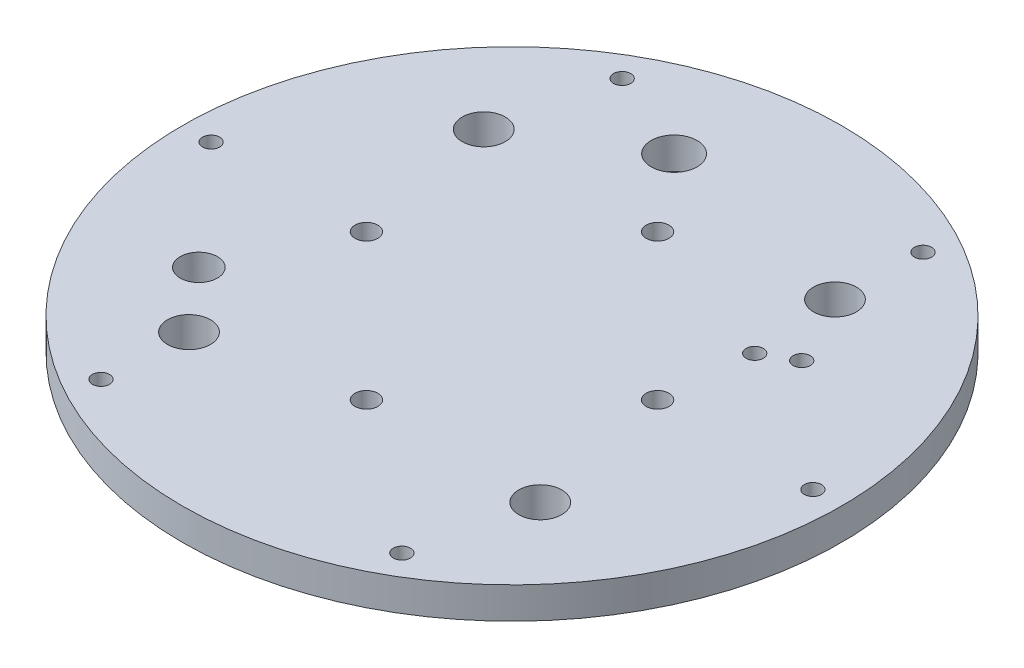
ISO-10303-21;
HEADER;
FILE_DESCRIPTION(('STEP AP214'),'2;1');
FILE_NAME('part.step','',(''),(''),'','','');
FILE_SCHEMA(('AUTOMOTIVE_DESIGN { 1 0 10303 214 1 1 1 1 }'));
ENDSEC;
DATA;
#1=APPLICATION_CONTEXT('core data for automotive mechanical design processes');
#2=APPLICATION_PROTOCOL_DEFINITION('international standard','automotive_design',2000,#1);
#3=PRODUCT_CONTEXT('',#1,'mechanical');
#4=PRODUCT('Part','Part','',(#3));
#5=PRODUCT_RELATED_PRODUCT_CATEGORY('part','',(#4));
#6=PRODUCT_DEFINITION_FORMATION('','',#4);
#7=PRODUCT_DEFINITION_CONTEXT('part definition',#1,'design');
#8=PRODUCT_DEFINITION('design','',#6,#7);
#9=PRODUCT_DEFINITION_SHAPE('','',#8);
#10=(LENGTH_UNIT() NAMED_UNIT(*) SI_UNIT(.MILLI.,.METRE.));
#11=(NAMED_UNIT(*) PLANE_ANGLE_UNIT() SI_UNIT($,.RADIAN.));
#12=(NAMED_UNIT(*) SI_UNIT($,.STERADIAN.) SOLID_ANGLE_UNIT());
#13=UNCERTAINTY_MEASURE_WITH_UNIT(LENGTH_MEASURE(1.E-05),#10,'distance_accuracy_value','');
#14=(GEOMETRIC_REPRESENTATION_CONTEXT(3) GLOBAL_UNCERTAINTY_ASSIGNED_CONTEXT((#13)) GLOBAL_UNIT_ASSIGNED_CONTEXT((#10,
#11,#12)) REPRESENTATION_CONTEXT('',''));
#15=CARTESIAN_POINT('',(0.,0.,0.));
#16=DIRECTION('',(0.,0.,1.));
#17=DIRECTION('',(1.,0.,0.));
#18=AXIS2_PLACEMENT_3D('',#15,#16,#17);
#19=CARTESIAN_POINT('',(0.,5.5,0.));
#20=DIRECTION('',(0.,1.,0.));
#21=DIRECTION('',(0.,0.,1.));
#22=AXIS2_PLACEMENT_3D('',#19,#20,#21);
#23=PLANE('',#22);
#24=CARTESIAN_POINT('',(-10.352761804101,5.5,-38.6370330515627));
#25=DIRECTION('',(0.,1.,0.));
#26=DIRECTION('',(0.,0.,1.));
#27=AXIS2_PLACEMENT_3D('',#24,#25,#26);
#28=CIRCLE('',#27,4.);
#29=CARTESIAN_POINT('',(-10.352761804101,5.5,-34.6370330515627));
#30=VERTEX_POINT('',#29);
#31=EDGE_CURVE('E132',#30,#30,#28,.T.);
#32=ORIENTED_EDGE('',*,*,#31,.F.);
#33=EDGE_LOOP('',(#32));
#34=FACE_BOUND('',#33,.T.);
#35=CARTESIAN_POINT('',(32.0429399400242,5.5,-18.5));
#36=DIRECTION('',(0.,1.,0.));
#37=DIRECTION('',(0.,0.,1.));
#38=AXIS2_PLACEMENT_3D('',#35,#36,#37);
#39=CIRCLE('',#38,1.50000000000001);
#40=CARTESIAN_POINT('',(32.0429399400242,5.5,-17.));
#41=VERTEX_POINT('',#40);
#42=EDGE_CURVE('E135',#41,#41,#39,.T.);
#43=ORIENTED_EDGE('',*,*,#42,.F.);
#44=EDGE_LOOP('',(#43));
#45=FACE_BOUND('',#44,.T.);
#46=CARTESIAN_POINT('',(26.8467875173176,5.5,-15.5));
#47=DIRECTION('',(0.,1.,0.));
#48=DIRECTION('',(0.,0.,1.));
#49=AXIS2_PLACEMENT_3D('',#46,#47,#48);
#50=CIRCLE('',#49,1.5);
#51=CARTESIAN_POINT('',(26.8467875173176,5.5,-14.));
#52=VERTEX_POINT('',#51);
#53=EDGE_CURVE('E138',#52,#52,#50,.T.);
#54=ORIENTED_EDGE('',*,*,#53,.F.);
#55=EDGE_LOOP('',(#54));
#56=FACE_BOUND('',#55,.T.);
#57=CARTESIAN_POINT('',(-34.6410161513777,5.5,19.9999999999998));
#58=DIRECTION('',(0.,1.,0.));
#59=DIRECTION('',(0.,0.,1.));
#60=AXIS2_PLACEMENT_3D('',#57,#58,#59);
#61=CIRCLE('',#60,3.24999999999999);
#62=CARTESIAN_POINT('',(-34.6410161513777,5.5,23.2499999999998));
#63=VERTEX_POINT('',#62);
#64=EDGE_CURVE('E113',#63,#63,#61,.T.);
#65=ORIENTED_EDGE('',*,*,#64,.F.);
#66=EDGE_LOOP('',(#65));
#67=FACE_BOUND('',#66,.T.);
#68=CARTESIAN_POINT('',(-25.7115043874616,5.5,30.6417777247591));
#69=DIRECTION('',(0.,1.,0.));
#70=DIRECTION('',(0.,0.,1.));
#71=AXIS2_PLACEMENT_3D('',#68,#69,#70);
#72=CIRCLE('',#71,3.75);
#73=CARTESIAN_POINT('',(-25.7115043874616,5.5,34.3917777247591));
#74=VERTEX_POINT('',#73);
#75=EDGE_CURVE('E109',#74,#74,#72,.T.);
#76=ORIENTED_EDGE('',*,*,#75,.F.);
#77=EDGE_LOOP('',(#76));
#78=FACE_BOUND('',#77,.T.);
#79=CARTESIAN_POINT('',(30.6417777247591,5.5,25.7115043874616));
#80=DIRECTION('',(0.,1.,0.));
#81=DIRECTION('',(0.,0.,1.));
#82=AXIS2_PLACEMENT_3D('',#79,#80,#81);
#83=CIRCLE('',#82,3.75);
#84=CARTESIAN_POINT('',(30.6417777247591,5.5,29.4615043874616));
#85=VERTEX_POINT('',#84);
#86=EDGE_CURVE('E116',#85,#85,#83,.T.);
#87=ORIENTED_EDGE('',*,*,#86,.F.);
#88=EDGE_LOOP('',(#87));
#89=FACE_BOUND('',#88,.T.);
#90=CARTESIAN_POINT('',(25.7115043874616,5.5,-30.6417777247591));
#91=DIRECTION('',(0.,1.,0.));
#92=DIRECTION('',(0.,0.,1.));
#93=AXIS2_PLACEMENT_3D('',#90,#91,#92);
#94=CIRCLE('',#93,3.75);
#95=CARTESIAN_POINT('',(25.7115043874616,5.5,-26.8917777247591));
#96=VERTEX_POINT('',#95);
#97=EDGE_CURVE('E122',#96,#96,#94,.T.);
#98=ORIENTED_EDGE('',*,*,#97,.F.);
#99=EDGE_LOOP('',(#98));
#100=FACE_BOUND('',#99,.T.);
#101=CARTESIAN_POINT('',(-30.6417777247591,5.5,-25.7115043874616));
#102=DIRECTION('',(0.,1.,0.));
#103=DIRECTION('',(0.,0.,1.));
#104=AXIS2_PLACEMENT_3D('',#101,#102,#103);
#105=CIRCLE('',#104,3.75);
#106=CARTESIAN_POINT('',(-30.6417777247591,5.5,-21.9615043874616));
#107=VERTEX_POINT('',#106);
#108=EDGE_CURVE('E103',#107,#107,#105,.T.);
#109=ORIENTED_EDGE('',*,*,#108,.F.);
#110=EDGE_LOOP('',(#109));
#111=FACE_BOUND('',#110,.T.);
#112=CARTESIAN_POINT('',(0.,5.5,-25.4));
#113=DIRECTION('',(0.,1.,0.));
#114=DIRECTION('',(0.,0.,1.));
#115=AXIS2_PLACEMENT_3D('',#112,#113,#114);
#116=CIRCLE('',#115,2.);
#117=CARTESIAN_POINT('',(0.,5.5,-23.4));
#118=VERTEX_POINT('',#117);
#119=EDGE_CURVE('E98',#118,#118,#116,.T.);
#120=ORIENTED_EDGE('',*,*,#119,.F.);
#121=EDGE_LOOP('',(#120));
#122=FACE_BOUND('',#121,.T.);
#123=CARTESIAN_POINT('',(25.4,5.5,0.));
#124=DIRECTION('',(0.,1.,0.));
#125=DIRECTION('',(0.,0.,1.));
#126=AXIS2_PLACEMENT_3D('',#123,#124,#125);
#127=CIRCLE('',#126,2.);
#128=CARTESIAN_POINT('',(25.4,5.5,2.));
#129=VERTEX_POINT('',#128);
#130=EDGE_CURVE('E92',#129,#129,#127,.T.);
#131=ORIENTED_EDGE('',*,*,#130,.F.);
#132=EDGE_LOOP('',(#131));
#133=FACE_BOUND('',#132,.T.);
#134=CARTESIAN_POINT('',(0.,5.5,25.4));
#135=DIRECTION('',(0.,1.,0.));
#136=DIRECTION('',(0.,0.,1.));
#137=AXIS2_PLACEMENT_3D('',#134,#135,#136);
#138=CIRCLE('',#137,2.);
#139=CARTESIAN_POINT('',(0.,5.5,27.4));
#140=VERTEX_POINT('',#139);
#141=EDGE_CURVE('E86',#140,#140,#138,.T.);
#142=ORIENTED_EDGE('',*,*,#141,.F.);
#143=EDGE_LOOP('',(#142));
#144=FACE_BOUND('',#143,.T.);
#145=CARTESIAN_POINT('',(-25.4,5.5,0.));
#146=DIRECTION('',(0.,1.,0.));
#147=DIRECTION('',(0.,0.,1.));
#148=AXIS2_PLACEMENT_3D('',#145,#146,#147);
#149=CIRCLE('',#148,2.);
#150=CARTESIAN_POINT('',(-25.4,5.5,2.));
#151=VERTEX_POINT('',#150);
#152=EDGE_CURVE('E79',#151,#151,#149,.T.);
#153=ORIENTED_EDGE('',*,*,#152,.F.);
#154=EDGE_LOOP('',(#153));
#155=FACE_BOUND('',#154,.T.);
#156=CARTESIAN_POINT('',(26.25,5.5,45.466333698683));
#157=DIRECTION('',(0.,1.,0.));
#158=DIRECTION('',(0.,0.,1.));
#159=AXIS2_PLACEMENT_3D('',#156,#157,#158);
#160=CIRCLE('',#159,1.5);
#161=CARTESIAN_POINT('',(26.25,5.5,46.966333698683));
#162=VERTEX_POINT('',#161);
#163=EDGE_CURVE('E64',#162,#162,#160,.T.);
#164=ORIENTED_EDGE('',*,*,#163,.F.);
#165=EDGE_LOOP('',(#164));
#166=FACE_BOUND('',#165,.T.);
#167=CARTESIAN_POINT('',(26.25,5.5,-45.466333698683));
#168=DIRECTION('',(0.,1.,0.));
#169=DIRECTION('',(0.,0.,1.));
#170=AXIS2_PLACEMENT_3D('',#167,#168,#169);
#171=CIRCLE('',#170,1.50000000000001);
#172=CARTESIAN_POINT('',(26.25,5.5,-43.966333698683));
#173=VERTEX_POINT('',#172);
#174=EDGE_CURVE('E52',#173,#173,#171,.T.);
#175=ORIENTED_EDGE('',*,*,#174,.F.);
#176=EDGE_LOOP('',(#175));
#177=FACE_BOUND('',#176,.T.);
#178=CARTESIAN_POINT('',(-52.5,5.5,0.));
#179=DIRECTION('',(0.,1.,0.));
#180=DIRECTION('',(0.,0.,1.));
#181=AXIS2_PLACEMENT_3D('',#178,#179,#180);
#182=CIRCLE('',#181,1.5);
#183=CARTESIAN_POINT('',(-52.5,5.5,1.50000000000001));
#184=VERTEX_POINT('',#183);
#185=EDGE_CURVE('E41',#184,#184,#182,.T.);
#186=ORIENTED_EDGE('',*,*,#185,.F.);
#187=EDGE_LOOP('',(#186));
#188=FACE_BOUND('',#187,.T.);
#189=CARTESIAN_POINT('',(0.,5.5,0.));
#190=DIRECTION('',(0.,1.,0.));
#191=DIRECTION('',(0.,0.,1.));
#192=AXIS2_PLACEMENT_3D('',#189,#190,#191);
#193=CIRCLE('',#192,57.5);
#194=CARTESIAN_POINT('',(0.,5.5,57.5));
#195=VERTEX_POINT('',#194);
#196=EDGE_CURVE('E10',#195,#195,#193,.T.);
#197=ORIENTED_EDGE('',*,*,#196,.T.);
#198=EDGE_LOOP('',(#197));
#199=FACE_BOUND('',#198,.T.);
#200=CARTESIAN_POINT('',(-26.25,5.5,-45.466333698683));
#201=DIRECTION('',(0.,1.,0.));
#202=DIRECTION('',(0.,0.,1.));
#203=AXIS2_PLACEMENT_3D('',#200,#201,#202);
#204=CIRCLE('',#203,1.5);
#205=CARTESIAN_POINT('',(-26.25,5.5,-43.966333698683));
#206=VERTEX_POINT('',#205);
#207=EDGE_CURVE('E46',#206,#206,#204,.T.);
#208=ORIENTED_EDGE('',*,*,#207,.F.);
#209=EDGE_LOOP('',(#208));
#210=FACE_BOUND('',#209,.T.);
#211=CARTESIAN_POINT('',(52.5,5.5,0.));
#212=DIRECTION('',(0.,1.,0.));
#213=DIRECTION('',(0.,0.,1.));
#214=AXIS2_PLACEMENT_3D('',#211,#212,#213);
#215=CIRCLE('',#214,1.5);
#216=CARTESIAN_POINT('',(52.5,5.5,1.49999999999999));
#217=VERTEX_POINT('',#216);
#218=EDGE_CURVE('E58',#217,#217,#215,.T.);
#219=ORIENTED_EDGE('',*,*,#218,.F.);
#220=EDGE_LOOP('',(#219));
#221=FACE_BOUND('',#220,.T.);
#222=CARTESIAN_POINT('',(-26.25,5.5,45.4663336986831));
#223=DIRECTION('',(0.,1.,0.));
#224=DIRECTION('',(0.,0.,1.));
#225=AXIS2_PLACEMENT_3D('',#222,#223,#224);
#226=CIRCLE('',#225,1.50000000000001);
#227=CARTESIAN_POINT('',(-26.25,5.5,46.9663336986831));
#228=VERTEX_POINT('',#227);
#229=EDGE_CURVE('E70',#228,#228,#226,.T.);
#230=ORIENTED_EDGE('',*,*,#229,.F.);
#231=EDGE_LOOP('',(#230));
#232=FACE_BOUND('',#231,.T.);
#233=ADVANCED_FACE('F30',(#34,#45,#56,#67,#78,#89,#100,#111,#122,#133,#144,#155,#166,#177,#188,
#199,#210,#221,#232),#23,.T.);
#234=CARTESIAN_POINT('',(0.,0.,0.));
#235=DIRECTION('',(0.,1.,0.));
#236=DIRECTION('',(0.,0.,1.));
#237=AXIS2_PLACEMENT_3D('',#234,#235,#236);
#238=PLANE('',#237);
#239=CARTESIAN_POINT('',(-10.352761804101,0.,-38.6370330515627));
#240=DIRECTION('',(0.,-1.,0.));
#241=DIRECTION('',(0.,0.,-1.));
#242=AXIS2_PLACEMENT_3D('',#239,#240,#241);
#243=CIRCLE('',#242,4.);
#244=CARTESIAN_POINT('',(-10.352761804101,0.,-42.6370330515627));
#245=VERTEX_POINT('',#244);
#246=EDGE_CURVE('E141',#245,#245,#243,.T.);
#247=ORIENTED_EDGE('',*,*,#246,.F.);
#248=EDGE_LOOP('',(#247));
#249=FACE_BOUND('',#248,.T.);
#250=CARTESIAN_POINT('',(32.0429399400242,0.,-18.5));
#251=DIRECTION('',(0.,-1.,0.));
#252=DIRECTION('',(0.,0.,-1.));
#253=AXIS2_PLACEMENT_3D('',#250,#251,#252);
#254=CIRCLE('',#253,1.50000000000001);
#255=CARTESIAN_POINT('',(32.0429399400242,0.,-20.));
#256=VERTEX_POINT('',#255);
#257=EDGE_CURVE('E145',#256,#256,#254,.T.);
#258=ORIENTED_EDGE('',*,*,#257,.F.);
#259=EDGE_LOOP('',(#258));
#260=FACE_BOUND('',#259,.T.);
#261=CARTESIAN_POINT('',(26.8467875173176,0.,-15.5));
#262=DIRECTION('',(0.,-1.,0.));
#263=DIRECTION('',(0.,0.,-1.));
#264=AXIS2_PLACEMENT_3D('',#261,#262,#263);
#265=CIRCLE('',#264,1.5);
#266=CARTESIAN_POINT('',(26.8467875173176,0.,-17.));
#267=VERTEX_POINT('',#266);
#268=EDGE_CURVE('E142',#267,#267,#265,.T.);
#269=ORIENTED_EDGE('',*,*,#268,.F.);
#270=EDGE_LOOP('',(#269));
#271=FACE_BOUND('',#270,.T.);
#272=CARTESIAN_POINT('',(-34.6410161513777,0.,19.9999999999998));
#273=DIRECTION('',(0.,-1.,0.));
#274=DIRECTION('',(0.,0.,-1.));
#275=AXIS2_PLACEMENT_3D('',#272,#273,#274);
#276=CIRCLE('',#275,3.24999999999999);
#277=CARTESIAN_POINT('',(-34.6410161513777,0.,16.7499999999998));
#278=VERTEX_POINT('',#277);
#279=EDGE_CURVE('E129',#278,#278,#276,.T.);
#280=ORIENTED_EDGE('',*,*,#279,.F.);
#281=EDGE_LOOP('',(#280));
#282=FACE_BOUND('',#281,.T.);
#283=CARTESIAN_POINT('',(-25.7115043874616,0.,30.6417777247591));
#284=DIRECTION('',(0.,1.,0.));
#285=DIRECTION('',(0.,0.,1.));
#286=AXIS2_PLACEMENT_3D('',#283,#284,#285);
#287=CIRCLE('',#286,3.75);
#288=CARTESIAN_POINT('',(-25.7115043874616,0.,34.3917777247591));
#289=VERTEX_POINT('',#288);
#290=EDGE_CURVE('E112',#289,#289,#287,.T.);
#291=ORIENTED_EDGE('',*,*,#290,.T.);
#292=EDGE_LOOP('',(#291));
#293=FACE_BOUND('',#292,.T.);
#294=CARTESIAN_POINT('',(30.6417777247591,0.,25.7115043874616));
#295=DIRECTION('',(0.,1.,0.));
#296=DIRECTION('',(0.,0.,1.));
#297=AXIS2_PLACEMENT_3D('',#294,#295,#296);
#298=CIRCLE('',#297,3.75);
#299=CARTESIAN_POINT('',(30.6417777247591,0.,29.4615043874616));
#300=VERTEX_POINT('',#299);
#301=EDGE_CURVE('E119',#300,#300,#298,.T.);
#302=ORIENTED_EDGE('',*,*,#301,.T.);
#303=EDGE_LOOP('',(#302));
#304=FACE_BOUND('',#303,.T.);
#305=CARTESIAN_POINT('',(25.7115043874616,0.,-30.6417777247591));
#306=DIRECTION('',(0.,1.,0.));
#307=DIRECTION('',(0.,0.,1.));
#308=AXIS2_PLACEMENT_3D('',#305,#306,#307);
#309=CIRCLE('',#308,3.75);
#310=CARTESIAN_POINT('',(25.7115043874616,0.,-26.8917777247591));
#311=VERTEX_POINT('',#310);
#312=EDGE_CURVE('E106',#311,#311,#309,.T.);
#313=ORIENTED_EDGE('',*,*,#312,.T.);
#314=EDGE_LOOP('',(#313));
#315=FACE_BOUND('',#314,.T.);
#316=CARTESIAN_POINT('',(-30.6417777247591,0.,-25.7115043874616));
#317=DIRECTION('',(0.,1.,0.));
#318=DIRECTION('',(0.,0.,1.));
#319=AXIS2_PLACEMENT_3D('',#316,#317,#318);
#320=CIRCLE('',#319,3.75);
#321=CARTESIAN_POINT('',(-30.6417777247591,0.,-21.9615043874616));
#322=VERTEX_POINT('',#321);
#323=EDGE_CURVE('E83',#322,#322,#320,.T.);
#324=ORIENTED_EDGE('',*,*,#323,.T.);
#325=EDGE_LOOP('',(#324));
#326=FACE_BOUND('',#325,.T.);
#327=CARTESIAN_POINT('',(0.,0.,-25.4));
#328=DIRECTION('',(0.,1.,0.));
#329=DIRECTION('',(0.,0.,1.));
#330=AXIS2_PLACEMENT_3D('',#327,#328,#329);
#331=CIRCLE('',#330,2.);
#332=CARTESIAN_POINT('',(0.,0.,-23.4));
#333=VERTEX_POINT('',#332);
#334=EDGE_CURVE('E76',#333,#333,#331,.T.);
#335=ORIENTED_EDGE('',*,*,#334,.T.);
#336=EDGE_LOOP('',(#335));
#337=FACE_BOUND('',#336,.T.);
#338=CARTESIAN_POINT('',(25.4,0.,0.));
#339=DIRECTION('',(0.,1.,0.));
#340=DIRECTION('',(0.,0.,1.));
#341=AXIS2_PLACEMENT_3D('',#338,#339,#340);
#342=CIRCLE('',#341,2.);
#343=CARTESIAN_POINT('',(25.4,0.,2.));
#344=VERTEX_POINT('',#343);
#345=EDGE_CURVE('E95',#344,#344,#342,.T.);
#346=ORIENTED_EDGE('',*,*,#345,.T.);
#347=EDGE_LOOP('',(#346));
#348=FACE_BOUND('',#347,.T.);
#349=CARTESIAN_POINT('',(0.,0.,25.4));
#350=DIRECTION('',(0.,1.,0.));
#351=DIRECTION('',(0.,0.,1.));
#352=AXIS2_PLACEMENT_3D('',#349,#350,#351);
#353=CIRCLE('',#352,2.);
#354=CARTESIAN_POINT('',(0.,0.,27.4));
#355=VERTEX_POINT('',#354);
#356=EDGE_CURVE('E89',#355,#355,#353,.T.);
#357=ORIENTED_EDGE('',*,*,#356,.T.);
#358=EDGE_LOOP('',(#357));
#359=FACE_BOUND('',#358,.T.);
#360=CARTESIAN_POINT('',(-25.4,0.,0.));
#361=DIRECTION('',(0.,1.,0.));
#362=DIRECTION('',(0.,0.,1.));
#363=AXIS2_PLACEMENT_3D('',#360,#361,#362);
#364=CIRCLE('',#363,2.);
#365=CARTESIAN_POINT('',(-25.4,0.,2.));
#366=VERTEX_POINT('',#365);
#367=EDGE_CURVE('E82',#366,#366,#364,.T.);
#368=ORIENTED_EDGE('',*,*,#367,.T.);
#369=EDGE_LOOP('',(#368));
#370=FACE_BOUND('',#369,.T.);
#371=CARTESIAN_POINT('',(0.,0.,0.));
#372=DIRECTION('',(0.,1.,0.));
#373=DIRECTION('',(0.,0.,1.));
#374=AXIS2_PLACEMENT_3D('',#371,#372,#373);
#375=CIRCLE('',#374,57.5);
#376=CARTESIAN_POINT('',(0.,0.,57.5));
#377=VERTEX_POINT('',#376);
#378=EDGE_CURVE('E34',#377,#377,#375,.T.);
#379=ORIENTED_EDGE('',*,*,#378,.F.);
#380=EDGE_LOOP('',(#379));
#381=FACE_BOUND('',#380,.T.);
#382=CARTESIAN_POINT('',(-52.5,0.,0.));
#383=DIRECTION('',(0.,1.,0.));
#384=DIRECTION('',(0.,0.,1.));
#385=AXIS2_PLACEMENT_3D('',#382,#383,#384);
#386=CIRCLE('',#385,1.5);
#387=CARTESIAN_POINT('',(-52.5,0.,1.50000000000001));
#388=VERTEX_POINT('',#387);
#389=EDGE_CURVE('E43',#388,#388,#386,.T.);
#390=ORIENTED_EDGE('',*,*,#389,.T.);
#391=EDGE_LOOP('',(#390));
#392=FACE_BOUND('',#391,.T.);
#393=CARTESIAN_POINT('',(-26.25,0.,-45.466333698683));
#394=DIRECTION('',(0.,1.,0.));
#395=DIRECTION('',(0.,0.,1.));
#396=AXIS2_PLACEMENT_3D('',#393,#394,#395);
#397=CIRCLE('',#396,1.5);
#398=CARTESIAN_POINT('',(-26.25,0.,-43.966333698683));
#399=VERTEX_POINT('',#398);
#400=EDGE_CURVE('E49',#399,#399,#397,.T.);
#401=ORIENTED_EDGE('',*,*,#400,.T.);
#402=EDGE_LOOP('',(#401));
#403=FACE_BOUND('',#402,.T.);
#404=CARTESIAN_POINT('',(26.25,0.,-45.466333698683));
#405=DIRECTION('',(0.,1.,0.));
#406=DIRECTION('',(0.,0.,1.));
#407=AXIS2_PLACEMENT_3D('',#404,#405,#406);
#408=CIRCLE('',#407,1.50000000000001);
#409=CARTESIAN_POINT('',(26.25,0.,-43.966333698683));
#410=VERTEX_POINT('',#409);
#411=EDGE_CURVE('E55',#410,#410,#408,.T.);
#412=ORIENTED_EDGE('',*,*,#411,.T.);
#413=EDGE_LOOP('',(#412));
#414=FACE_BOUND('',#413,.T.);
#415=CARTESIAN_POINT('',(52.5,0.,0.));
#416=DIRECTION('',(0.,1.,0.));
#417=DIRECTION('',(0.,0.,1.));
#418=AXIS2_PLACEMENT_3D('',#415,#416,#417);
#419=CIRCLE('',#418,1.5);
#420=CARTESIAN_POINT('',(52.5,0.,1.49999999999999));
#421=VERTEX_POINT('',#420);
#422=EDGE_CURVE('E61',#421,#421,#419,.T.);
#423=ORIENTED_EDGE('',*,*,#422,.T.);
#424=EDGE_LOOP('',(#423));
#425=FACE_BOUND('',#424,.T.);
#426=CARTESIAN_POINT('',(26.25,0.,45.466333698683));
#427=DIRECTION('',(0.,1.,0.));
#428=DIRECTION('',(0.,0.,1.));
#429=AXIS2_PLACEMENT_3D('',#426,#427,#428);
#430=CIRCLE('',#429,1.5);
#431=CARTESIAN_POINT('',(26.25,0.,46.966333698683));
#432=VERTEX_POINT('',#431);
#433=EDGE_CURVE('E67',#432,#432,#430,.T.);
#434=ORIENTED_EDGE('',*,*,#433,.T.);
#435=EDGE_LOOP('',(#434));
#436=FACE_BOUND('',#435,.T.);
#437=CARTESIAN_POINT('',(-26.25,0.,45.4663336986831));
#438=DIRECTION('',(0.,1.,0.));
#439=DIRECTION('',(0.,0.,1.));
#440=AXIS2_PLACEMENT_3D('',#437,#438,#439);
#441=CIRCLE('',#440,1.50000000000001);
#442=CARTESIAN_POINT('',(-26.25,0.,46.9663336986831));
#443=VERTEX_POINT('',#442);
#444=EDGE_CURVE('E73',#443,#443,#441,.T.);
#445=ORIENTED_EDGE('',*,*,#444,.T.);
#446=EDGE_LOOP('',(#445));
#447=FACE_BOUND('',#446,.T.);
#448=ADVANCED_FACE('F153',(#249,#260,#271,#282,#293,#304,#315,#326,#337,#348,#359,#370,#381,
#392,#403,#414,#425,#436,#447),#238,.F.);
#449=CARTESIAN_POINT('',(0.,5.5,0.));
#450=DIRECTION('',(0.,-1.,0.));
#451=DIRECTION('',(0.,0.,-1.));
#452=AXIS2_PLACEMENT_3D('',#449,#450,#451);
#453=CYLINDRICAL_SURFACE('',#452,57.5);
#454=ORIENTED_EDGE('',*,*,#196,.F.);
#455=EDGE_LOOP('',(#454));
#456=FACE_BOUND('',#455,.T.);
#457=ORIENTED_EDGE('',*,*,#378,.T.);
#458=EDGE_LOOP('',(#457));
#459=FACE_BOUND('',#458,.T.);
#460=ADVANCED_FACE('F32',(#456,#459),#453,.T.);
#461=CARTESIAN_POINT('',(-52.5,5.5,0.));
#462=DIRECTION('',(0.,-1.,0.));
#463=DIRECTION('',(0.,0.,-1.));
#464=AXIS2_PLACEMENT_3D('',#461,#462,#463);
#465=CYLINDRICAL_SURFACE('',#464,1.5);
#466=ORIENTED_EDGE('',*,*,#185,.T.);
#467=EDGE_LOOP('',(#466));
#468=FACE_BOUND('',#467,.T.);
#469=ORIENTED_EDGE('',*,*,#389,.F.);
#470=EDGE_LOOP('',(#469));
#471=FACE_BOUND('',#470,.T.);
#472=ADVANCED_FACE('F216',(#468,#471),#465,.F.);
#473=CARTESIAN_POINT('',(-26.25,5.5,-45.466333698683));
#474=DIRECTION('',(0.,-1.,0.));
#475=DIRECTION('',(0.,0.,-1.));
#476=AXIS2_PLACEMENT_3D('',#473,#474,#475);
#477=CYLINDRICAL_SURFACE('',#476,1.5);
#478=ORIENTED_EDGE('',*,*,#207,.T.);
#479=EDGE_LOOP('',(#478));
#480=FACE_BOUND('',#479,.T.);
#481=ORIENTED_EDGE('',*,*,#400,.F.);
#482=EDGE_LOOP('',(#481));
#483=FACE_BOUND('',#482,.T.);
#484=ADVANCED_FACE('F219',(#480,#483),#477,.F.);
#485=CARTESIAN_POINT('',(26.25,5.5,-45.466333698683));
#486=DIRECTION('',(0.,-1.,0.));
#487=DIRECTION('',(0.,0.,-1.));
#488=AXIS2_PLACEMENT_3D('',#485,#486,#487);
#489=CYLINDRICAL_SURFACE('',#488,1.50000000000001);
#490=ORIENTED_EDGE('',*,*,#174,.T.);
#491=EDGE_LOOP('',(#490));
#492=FACE_BOUND('',#491,.T.);
#493=ORIENTED_EDGE('',*,*,#411,.F.);
#494=EDGE_LOOP('',(#493));
#495=FACE_BOUND('',#494,.T.);
#496=ADVANCED_FACE('F223',(#492,#495),#489,.F.);
#497=CARTESIAN_POINT('',(52.5,5.5,0.));
#498=DIRECTION('',(0.,-1.,0.));
#499=DIRECTION('',(0.,0.,-1.));
#500=AXIS2_PLACEMENT_3D('',#497,#498,#499);
#501=CYLINDRICAL_SURFACE('',#500,1.5);
#502=ORIENTED_EDGE('',*,*,#218,.T.);
#503=EDGE_LOOP('',(#502));
#504=FACE_BOUND('',#503,.T.);
#505=ORIENTED_EDGE('',*,*,#422,.F.);
#506=EDGE_LOOP('',(#505));
#507=FACE_BOUND('',#506,.T.);
#508=ADVANCED_FACE('F205',(#504,#507),#501,.F.);
#509=CARTESIAN_POINT('',(26.25,5.5,45.466333698683));
#510=DIRECTION('',(0.,-1.,0.));
#511=DIRECTION('',(0.,0.,-1.));
#512=AXIS2_PLACEMENT_3D('',#509,#510,#511);
#513=CYLINDRICAL_SURFACE('',#512,1.5);
#514=ORIENTED_EDGE('',*,*,#163,.T.);
#515=EDGE_LOOP('',(#514));
#516=FACE_BOUND('',#515,.T.);
#517=ORIENTED_EDGE('',*,*,#433,.F.);
#518=EDGE_LOOP('',(#517));
#519=FACE_BOUND('',#518,.T.);
#520=ADVANCED_FACE('F195',(#516,#519),#513,.F.);
#521=CARTESIAN_POINT('',(-26.25,5.5,45.4663336986831));
#522=DIRECTION('',(0.,-1.,0.));
#523=DIRECTION('',(0.,0.,-1.));
#524=AXIS2_PLACEMENT_3D('',#521,#522,#523);
#525=CYLINDRICAL_SURFACE('',#524,1.50000000000001);
#526=ORIENTED_EDGE('',*,*,#229,.T.);
#527=EDGE_LOOP('',(#526));
#528=FACE_BOUND('',#527,.T.);
#529=ORIENTED_EDGE('',*,*,#444,.F.);
#530=EDGE_LOOP('',(#529));
#531=FACE_BOUND('',#530,.T.);
#532=ADVANCED_FACE('F192',(#528,#531),#525,.F.);
#533=CARTESIAN_POINT('',(-25.4,0.,0.));
#534=DIRECTION('',(0.,1.,0.));
#535=DIRECTION('',(0.,0.,1.));
#536=AXIS2_PLACEMENT_3D('',#533,#534,#535);
#537=CYLINDRICAL_SURFACE('',#536,2.);
#538=ORIENTED_EDGE('',*,*,#367,.F.);
#539=EDGE_LOOP('',(#538));
#540=FACE_BOUND('',#539,.T.);
#541=ORIENTED_EDGE('',*,*,#152,.T.);
#542=EDGE_LOOP('',(#541));
#543=FACE_BOUND('',#542,.T.);
#544=ADVANCED_FACE('F194',(#540,#543),#537,.F.);
#545=CARTESIAN_POINT('',(0.,0.,25.4));
#546=DIRECTION('',(0.,1.,0.));
#547=DIRECTION('',(0.,0.,1.));
#548=AXIS2_PLACEMENT_3D('',#545,#546,#547);
#549=CYLINDRICAL_SURFACE('',#548,2.);
#550=ORIENTED_EDGE('',*,*,#356,.F.);
#551=EDGE_LOOP('',(#550));
#552=FACE_BOUND('',#551,.T.);
#553=ORIENTED_EDGE('',*,*,#141,.T.);
#554=EDGE_LOOP('',(#553));
#555=FACE_BOUND('',#554,.T.);
#556=ADVANCED_FACE('F202',(#552,#555),#549,.F.);
#557=CARTESIAN_POINT('',(25.4,0.,0.));
#558=DIRECTION('',(0.,1.,0.));
#559=DIRECTION('',(0.,0.,1.));
#560=AXIS2_PLACEMENT_3D('',#557,#558,#559);
#561=CYLINDRICAL_SURFACE('',#560,2.);
#562=ORIENTED_EDGE('',*,*,#345,.F.);
#563=EDGE_LOOP('',(#562));
#564=FACE_BOUND('',#563,.T.);
#565=ORIENTED_EDGE('',*,*,#130,.T.);
#566=EDGE_LOOP('',(#565));
#567=FACE_BOUND('',#566,.T.);
#568=ADVANCED_FACE('F262',(#564,#567),#561,.F.);
#569=CARTESIAN_POINT('',(0.,0.,-25.4));
#570=DIRECTION('',(0.,1.,0.));
#571=DIRECTION('',(0.,0.,1.));
#572=AXIS2_PLACEMENT_3D('',#569,#570,#571);
#573=CYLINDRICAL_SURFACE('',#572,2.);
#574=ORIENTED_EDGE('',*,*,#334,.F.);
#575=EDGE_LOOP('',(#574));
#576=FACE_BOUND('',#575,.T.);
#577=ORIENTED_EDGE('',*,*,#119,.T.);
#578=EDGE_LOOP('',(#577));
#579=FACE_BOUND('',#578,.T.);
#580=ADVANCED_FACE('F272',(#576,#579),#573,.F.);
#581=CARTESIAN_POINT('',(-30.6417777247591,0.,-25.7115043874616));
#582=DIRECTION('',(0.,1.,0.));
#583=DIRECTION('',(0.,0.,1.));
#584=AXIS2_PLACEMENT_3D('',#581,#582,#583);
#585=CYLINDRICAL_SURFACE('',#584,3.75);
#586=ORIENTED_EDGE('',*,*,#323,.F.);
#587=EDGE_LOOP('',(#586));
#588=FACE_BOUND('',#587,.T.);
#589=ORIENTED_EDGE('',*,*,#108,.T.);
#590=EDGE_LOOP('',(#589));
#591=FACE_BOUND('',#590,.T.);
#592=ADVANCED_FACE('F282',(#588,#591),#585,.F.);
#593=CARTESIAN_POINT('',(25.7115043874616,0.,-30.6417777247591));
#594=DIRECTION('',(0.,1.,0.));
#595=DIRECTION('',(0.,0.,1.));
#596=AXIS2_PLACEMENT_3D('',#593,#594,#595);
#597=CYLINDRICAL_SURFACE('',#596,3.75);
#598=ORIENTED_EDGE('',*,*,#312,.F.);
#599=EDGE_LOOP('',(#598));
#600=FACE_BOUND('',#599,.T.);
#601=ORIENTED_EDGE('',*,*,#97,.T.);
#602=EDGE_LOOP('',(#601));
#603=FACE_BOUND('',#602,.T.);
#604=ADVANCED_FACE('F292',(#600,#603),#597,.F.);
#605=CARTESIAN_POINT('',(30.6417777247591,0.,25.7115043874616));
#606=DIRECTION('',(0.,1.,0.));
#607=DIRECTION('',(0.,0.,1.));
#608=AXIS2_PLACEMENT_3D('',#605,#606,#607);
#609=CYLINDRICAL_SURFACE('',#608,3.75);
#610=ORIENTED_EDGE('',*,*,#301,.F.);
#611=EDGE_LOOP('',(#610));
#612=FACE_BOUND('',#611,.T.);
#613=ORIENTED_EDGE('',*,*,#86,.T.);
#614=EDGE_LOOP('',(#613));
#615=FACE_BOUND('',#614,.T.);
#616=ADVANCED_FACE('F302',(#612,#615),#609,.F.);
#617=CARTESIAN_POINT('',(-25.7115043874616,0.,30.6417777247591));
#618=DIRECTION('',(0.,1.,0.));
#619=DIRECTION('',(0.,0.,1.));
#620=AXIS2_PLACEMENT_3D('',#617,#618,#619);
#621=CYLINDRICAL_SURFACE('',#620,3.75);
#622=ORIENTED_EDGE('',*,*,#290,.F.);
#623=EDGE_LOOP('',(#622));
#624=FACE_BOUND('',#623,.T.);
#625=ORIENTED_EDGE('',*,*,#75,.T.);
#626=EDGE_LOOP('',(#625));
#627=FACE_BOUND('',#626,.T.);
#628=ADVANCED_FACE('F312',(#624,#627),#621,.F.);
#629=CARTESIAN_POINT('',(-34.6410161513777,10.,19.9999999999998));
#630=DIRECTION('',(0.,-1.,0.));
#631=DIRECTION('',(0.,0.,-1.));
#632=AXIS2_PLACEMENT_3D('',#629,#630,#631);
#633=CYLINDRICAL_SURFACE('',#632,3.24999999999999);
#634=ORIENTED_EDGE('',*,*,#64,.T.);
#635=EDGE_LOOP('',(#634));
#636=FACE_BOUND('',#635,.T.);
#637=ORIENTED_EDGE('',*,*,#279,.T.);
#638=EDGE_LOOP('',(#637));
#639=FACE_BOUND('',#638,.T.);
#640=ADVANCED_FACE('F322',(#636,#639),#633,.F.);
#641=CARTESIAN_POINT('',(26.8467875173176,10.,-15.5));
#642=DIRECTION('',(0.,-1.,0.));
#643=DIRECTION('',(0.,0.,-1.));
#644=AXIS2_PLACEMENT_3D('',#641,#642,#643);
#645=CYLINDRICAL_SURFACE('',#644,1.5);
#646=ORIENTED_EDGE('',*,*,#53,.T.);
#647=EDGE_LOOP('',(#646));
#648=FACE_BOUND('',#647,.T.);
#649=ORIENTED_EDGE('',*,*,#268,.T.);
#650=EDGE_LOOP('',(#649));
#651=FACE_BOUND('',#650,.T.);
#652=ADVANCED_FACE('F331',(#648,#651),#645,.F.);
#653=CARTESIAN_POINT('',(32.0429399400242,10.,-18.5));
#654=DIRECTION('',(0.,-1.,0.));
#655=DIRECTION('',(0.,0.,-1.));
#656=AXIS2_PLACEMENT_3D('',#653,#654,#655);
#657=CYLINDRICAL_SURFACE('',#656,1.50000000000001);
#658=ORIENTED_EDGE('',*,*,#42,.T.);
#659=EDGE_LOOP('',(#658));
#660=FACE_BOUND('',#659,.T.);
#661=ORIENTED_EDGE('',*,*,#257,.T.);
#662=EDGE_LOOP('',(#661));
#663=FACE_BOUND('',#662,.T.);
#664=ADVANCED_FACE('F354',(#660,#663),#657,.F.);
#665=CARTESIAN_POINT('',(-10.352761804101,10.,-38.6370330515627));
#666=DIRECTION('',(0.,-1.,0.));
#667=DIRECTION('',(0.,0.,-1.));
#668=AXIS2_PLACEMENT_3D('',#665,#666,#667);
#669=CYLINDRICAL_SURFACE('',#668,4.);
#670=ORIENTED_EDGE('',*,*,#31,.T.);
#671=EDGE_LOOP('',(#670));
#672=FACE_BOUND('',#671,.T.);
#673=ORIENTED_EDGE('',*,*,#246,.T.);
#674=EDGE_LOOP('',(#673));
#675=FACE_BOUND('',#674,.T.);
#676=ADVANCED_FACE('F151',(#672,#675),#669,.F.);
#677=CLOSED_SHELL('',(#233,#448,#460,#472,#484,#496,#508,#520,#532,#544,#556,#568,#580,#592,
#604,#616,#628,#640,#652,#664,#676));
#678=MANIFOLD_SOLID_BREP('B2',#677);
#679=ADVANCED_BREP_SHAPE_REPRESENTATION('',(#18,#678),#14);
#680=SHAPE_DEFINITION_REPRESENTATION(#9,#679);
ENDSEC;
END-ISO-10303-21;
